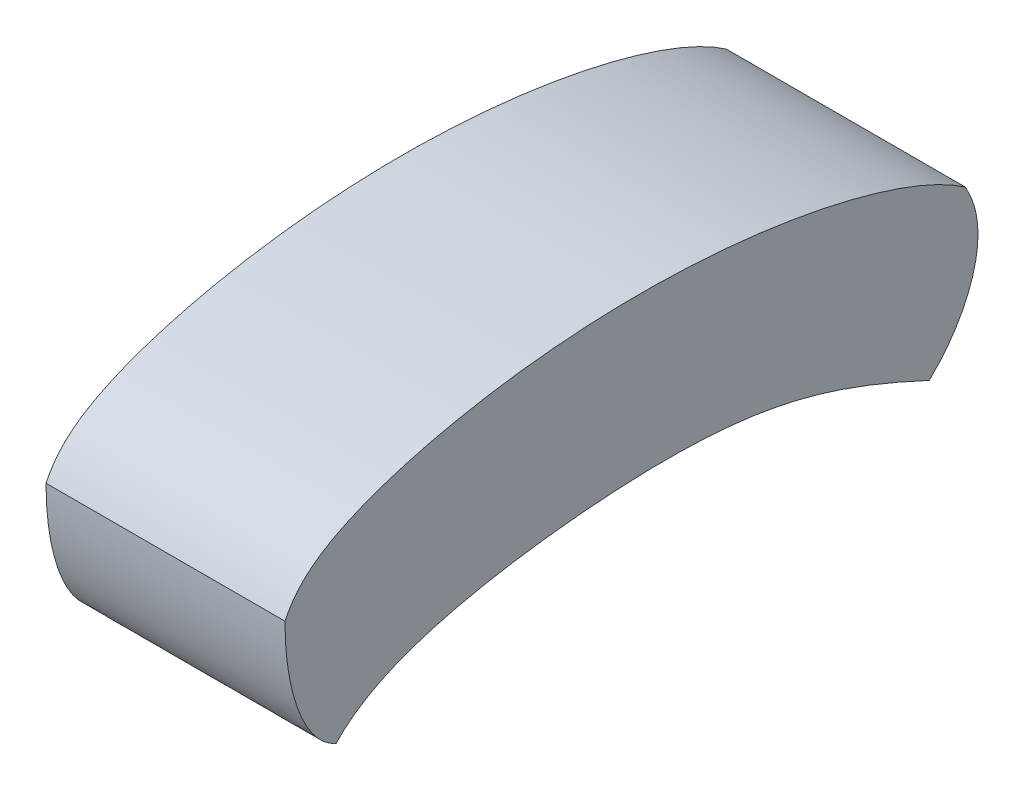
ISO-10303-21;
HEADER;
FILE_DESCRIPTION(('STEP AP214'),'2;1');
FILE_NAME('part.step','',(''),(''),'','','');
FILE_SCHEMA(('AUTOMOTIVE_DESIGN { 1 0 10303 214 1 1 1 1 }'));
ENDSEC;
DATA;
#1=APPLICATION_CONTEXT('core data for automotive mechanical design processes');
#2=APPLICATION_PROTOCOL_DEFINITION('international standard','automotive_design',2000,#1);
#3=PRODUCT_CONTEXT('',#1,'mechanical');
#4=PRODUCT('Part','Part','',(#3));
#5=PRODUCT_RELATED_PRODUCT_CATEGORY('part','',(#4));
#6=PRODUCT_DEFINITION_FORMATION('','',#4);
#7=PRODUCT_DEFINITION_CONTEXT('part definition',#1,'design');
#8=PRODUCT_DEFINITION('design','',#6,#7);
#9=PRODUCT_DEFINITION_SHAPE('','',#8);
#10=(LENGTH_UNIT() NAMED_UNIT(*) SI_UNIT(.MILLI.,.METRE.));
#11=(NAMED_UNIT(*) PLANE_ANGLE_UNIT() SI_UNIT($,.RADIAN.));
#12=(NAMED_UNIT(*) SI_UNIT($,.STERADIAN.) SOLID_ANGLE_UNIT());
#13=UNCERTAINTY_MEASURE_WITH_UNIT(LENGTH_MEASURE(1.E-05),#10,'distance_accuracy_value','');
#14=(GEOMETRIC_REPRESENTATION_CONTEXT(3) GLOBAL_UNCERTAINTY_ASSIGNED_CONTEXT((#13)) GLOBAL_UNIT_ASSIGNED_CONTEXT((#10,
#11,#12)) REPRESENTATION_CONTEXT('',''));
#15=CARTESIAN_POINT('',(0.,0.,0.));
#16=DIRECTION('',(0.,0.,1.));
#17=DIRECTION('',(1.,0.,0.));
#18=AXIS2_PLACEMENT_3D('',#15,#16,#17);
#19=CARTESIAN_POINT('',(-120.,-7.7668418799346,206.219942205809));
#20=CARTESIAN_POINT('',(-120.,-40.3753479847674,206.219942205809));
#21=CARTESIAN_POINT('',(-120.,-67.1771863531175,196.208397878389));
#22=CARTESIAN_POINT('',(-120.,-73.7668418799346,180.471436413235));
#23=B_SPLINE_CURVE_WITH_KNOTS('',3,(#19,#20,#21,#22),.UNSPECIFIED.,.F.,.F.,(4,4),(0.,1.),.UNSPECIFIED.);
#24=DIRECTION('',(1.,0.,0.));
#25=VECTOR('',#24,1.);
#26=SURFACE_OF_LINEAR_EXTRUSION('',#23,#25);
#27=CARTESIAN_POINT('',(0.,-7.7668418799346,206.219942205809));
#28=CARTESIAN_POINT('',(0.,-40.3753479847674,206.219942205809));
#29=CARTESIAN_POINT('',(0.,-67.1771863531175,196.208397878389));
#30=CARTESIAN_POINT('',(0.,-73.7668418799346,180.471436413235));
#31=B_SPLINE_CURVE_WITH_KNOTS('',3,(#27,#28,#29,#30),.UNSPECIFIED.,.F.,.F.,(4,4),(0.,1.),.UNSPECIFIED.);
#32=CARTESIAN_POINT('',(0.,-7.7668418799346,206.219942205809));
#33=VERTEX_POINT('',#32);
#34=CARTESIAN_POINT('',(0.,-73.7668418799346,180.471436413235));
#35=VERTEX_POINT('',#34);
#36=EDGE_CURVE('E129',#33,#35,#31,.T.);
#37=ORIENTED_EDGE('',*,*,#36,.F.);
#38=DIRECTION('',(1.,0.,0.));
#39=VECTOR('',#38,1.);
#40=CARTESIAN_POINT('',(-120.,-7.7668418799346,206.219942205809));
#41=LINE('',#40,#39);
#42=CARTESIAN_POINT('',(-120.,-7.7668418799346,206.219942205809));
#43=VERTEX_POINT('',#42);
#44=EDGE_CURVE('E11',#43,#33,#41,.T.);
#45=ORIENTED_EDGE('',*,*,#44,.F.);
#46=CARTESIAN_POINT('',(-120.,-73.7668418799346,180.471436413235));
#47=VERTEX_POINT('',#46);
#48=EDGE_CURVE('E100',#43,#47,#23,.T.);
#49=ORIENTED_EDGE('',*,*,#48,.T.);
#50=DIRECTION('',(1.,0.,0.));
#51=VECTOR('',#50,1.);
#52=CARTESIAN_POINT('',(-120.,-73.7668418799346,180.471436413235));
#53=LINE('',#52,#51);
#54=EDGE_CURVE('E45',#47,#35,#53,.T.);
#55=ORIENTED_EDGE('',*,*,#54,.T.);
#56=EDGE_LOOP('',(#37,#45,#49,#55));
#57=FACE_BOUND('',#56,.T.);
#58=ADVANCED_FACE('F41',(#57),#26,.T.);
#59=CARTESIAN_POINT('',(-120.,10.2732919844896,-135.38175136237));
#60=CARTESIAN_POINT('',(-120.,30.7881800122377,-105.564219998052));
#61=CARTESIAN_POINT('',(-120.,47.1621964827488,-49.8854655813096));
#62=CARTESIAN_POINT('',(-120.,57.7869736278701,39.9699945070684));
#63=CARTESIAN_POINT('',(-120.,48.743530735788,96.7546484192631));
#64=CARTESIAN_POINT('',(-120.,28.4154140411429,172.026174022097));
#65=CARTESIAN_POINT('',(-120.,17.7508769704576,193.804570038754));
#66=CARTESIAN_POINT('',(-120.,-7.7668418799346,206.219942205809));
#67=B_SPLINE_CURVE_WITH_KNOTS('',7,(#59,#60,#61,#62,#63,#64,#65,#66),.UNSPECIFIED.,.F.,.F.,(8,
8),(0.,1.),.UNSPECIFIED.);
#68=DIRECTION('',(1.,0.,0.));
#69=VECTOR('',#68,1.);
#70=SURFACE_OF_LINEAR_EXTRUSION('',#67,#69);
#71=CARTESIAN_POINT('',(0.,10.2732919844896,-135.38175136237));
#72=CARTESIAN_POINT('',(0.,30.7881800122377,-105.564219998052));
#73=CARTESIAN_POINT('',(0.,47.1621964827488,-49.8854655813096));
#74=CARTESIAN_POINT('',(0.,57.7869736278701,39.9699945070684));
#75=CARTESIAN_POINT('',(0.,48.743530735788,96.7546484192631));
#76=CARTESIAN_POINT('',(0.,28.4154140411429,172.026174022097));
#77=CARTESIAN_POINT('',(0.,17.7508769704576,193.804570038754));
#78=CARTESIAN_POINT('',(0.,-7.7668418799346,206.219942205809));
#79=B_SPLINE_CURVE_WITH_KNOTS('',7,(#71,#72,#73,#74,#75,#76,#77,#78),.UNSPECIFIED.,.F.,.F.,(8,
8),(0.,1.),.UNSPECIFIED.);
#80=CARTESIAN_POINT('',(0.,10.2732919844896,-135.38175136237));
#81=VERTEX_POINT('',#80);
#82=EDGE_CURVE('E102',#81,#33,#79,.T.);
#83=ORIENTED_EDGE('',*,*,#82,.F.);
#84=DIRECTION('',(1.,0.,0.));
#85=VECTOR('',#84,1.);
#86=CARTESIAN_POINT('',(-120.,10.2732919844896,-135.38175136237));
#87=LINE('',#86,#85);
#88=CARTESIAN_POINT('',(-120.,10.2732919844896,-135.38175136237));
#89=VERTEX_POINT('',#88);
#90=EDGE_CURVE('E51',#89,#81,#87,.T.);
#91=ORIENTED_EDGE('',*,*,#90,.F.);
#92=EDGE_CURVE('E97',#89,#43,#67,.T.);
#93=ORIENTED_EDGE('',*,*,#92,.T.);
#94=ORIENTED_EDGE('',*,*,#44,.T.);
#95=EDGE_LOOP('',(#83,#91,#93,#94));
#96=FACE_BOUND('',#95,.T.);
#97=ADVANCED_FACE('F120',(#96),#70,.T.);
#98=CARTESIAN_POINT('',(-120.,-64.8462005363146,-117.340743827617));
#99=CARTESIAN_POINT('',(-120.,-45.9949308062452,-137.462177042785));
#100=CARTESIAN_POINT('',(-120.,-22.2461543438269,-144.715585034908));
#101=CARTESIAN_POINT('',(-120.,-6.18582652069124,-144.715585034908));
#102=CARTESIAN_POINT('',(-120.,10.2732919844896,-135.38175136237));
#103=B_SPLINE_CURVE_WITH_KNOTS('',4,(#98,#99,#100,#101,#102),.UNSPECIFIED.,.F.,.F.,(5,5),(0.,
1.),.UNSPECIFIED.);
#104=DIRECTION('',(1.,0.,0.));
#105=VECTOR('',#104,1.);
#106=SURFACE_OF_LINEAR_EXTRUSION('',#103,#105);
#107=CARTESIAN_POINT('',(0.,-64.8462005363146,-117.340743827617));
#108=CARTESIAN_POINT('',(0.,-45.9949308062452,-137.462177042785));
#109=CARTESIAN_POINT('',(0.,-22.2461543438269,-144.715585034908));
#110=CARTESIAN_POINT('',(0.,-6.18582652069124,-144.715585034908));
#111=CARTESIAN_POINT('',(0.,10.2732919844896,-135.38175136237));
#112=B_SPLINE_CURVE_WITH_KNOTS('',4,(#107,#108,#109,#110,#111),.UNSPECIFIED.,.F.,.F.,(5,5),(0.,
1.),.UNSPECIFIED.);
#113=CARTESIAN_POINT('',(0.,-64.8462005363146,-117.340743827617));
#114=VERTEX_POINT('',#113);
#115=EDGE_CURVE('E92',#114,#81,#112,.T.);
#116=ORIENTED_EDGE('',*,*,#115,.F.);
#117=DIRECTION('',(1.,0.,0.));
#118=VECTOR('',#117,1.);
#119=CARTESIAN_POINT('',(-120.,-64.8462005363146,-117.340743827617));
#120=LINE('',#119,#118);
#121=CARTESIAN_POINT('',(-120.,-64.8462005363146,-117.340743827617));
#122=VERTEX_POINT('',#121);
#123=EDGE_CURVE('E87',#122,#114,#120,.T.);
#124=ORIENTED_EDGE('',*,*,#123,.F.);
#125=EDGE_CURVE('E90',#122,#89,#103,.T.);
#126=ORIENTED_EDGE('',*,*,#125,.T.);
#127=ORIENTED_EDGE('',*,*,#90,.T.);
#128=EDGE_LOOP('',(#116,#124,#126,#127));
#129=FACE_BOUND('',#128,.T.);
#130=ADVANCED_FACE('F89',(#129),#106,.T.);
#131=CARTESIAN_POINT('',(-120.,-73.7668418799346,180.471436413235));
#132=CARTESIAN_POINT('',(-120.,-45.6325114885177,154.395715562654));
#133=CARTESIAN_POINT('',(-120.,-31.9084478829484,96.7546484192631));
#134=CARTESIAN_POINT('',(-120.,-31.9084478829484,-3.43101590139225));
#135=CARTESIAN_POINT('',(-120.,-21.6154001787715,-24.7033144900245));
#136=CARTESIAN_POINT('',(-120.,-64.8462005363146,-117.340743827617));
#137=B_SPLINE_CURVE_WITH_KNOTS('',5,(#131,#132,#133,#134,#135,#136),.UNSPECIFIED.,.F.,.F.,(6,6),
(0.,1.),.UNSPECIFIED.);
#138=DIRECTION('',(1.,0.,0.));
#139=VECTOR('',#138,1.);
#140=SURFACE_OF_LINEAR_EXTRUSION('',#137,#139);
#141=CARTESIAN_POINT('',(0.,-73.7668418799346,180.471436413235));
#142=CARTESIAN_POINT('',(0.,-45.6325114885177,154.395715562654));
#143=CARTESIAN_POINT('',(0.,-31.9084478829484,96.7546484192631));
#144=CARTESIAN_POINT('',(0.,-31.9084478829484,-3.43101590139225));
#145=CARTESIAN_POINT('',(0.,-21.6154001787715,-24.7033144900245));
#146=CARTESIAN_POINT('',(0.,-64.8462005363146,-117.340743827617));
#147=B_SPLINE_CURVE_WITH_KNOTS('',5,(#141,#142,#143,#144,#145,#146),.UNSPECIFIED.,.F.,.F.,(6,6),
(0.,1.),.UNSPECIFIED.);
#148=EDGE_CURVE('E137',#35,#114,#147,.T.);
#149=ORIENTED_EDGE('',*,*,#148,.F.);
#150=ORIENTED_EDGE('',*,*,#54,.F.);
#151=EDGE_CURVE('E96',#47,#122,#137,.T.);
#152=ORIENTED_EDGE('',*,*,#151,.T.);
#153=ORIENTED_EDGE('',*,*,#123,.T.);
#154=EDGE_LOOP('',(#149,#150,#152,#153));
#155=FACE_BOUND('',#154,.T.);
#156=ADVANCED_FACE('F99',(#155),#140,.T.);
#157=CARTESIAN_POINT('',(-120.,-50.5239108466905,199.247049858955));
#158=DIRECTION('',(1.,0.,0.));
#159=DIRECTION('',(0.,0.,-1.));
#160=AXIS2_PLACEMENT_3D('',#157,#158,#159);
#161=PLANE('',#160);
#162=ORIENTED_EDGE('',*,*,#48,.F.);
#163=ORIENTED_EDGE('',*,*,#92,.F.);
#164=ORIENTED_EDGE('',*,*,#125,.F.);
#165=ORIENTED_EDGE('',*,*,#151,.F.);
#166=EDGE_LOOP('',(#162,#163,#164,#165));
#167=FACE_BOUND('',#166,.T.);
#168=ADVANCED_FACE('F95',(#167),#161,.F.);
#169=CARTESIAN_POINT('',(0.,-50.5239108466905,199.247049858955));
#170=DIRECTION('',(1.,0.,0.));
#171=DIRECTION('',(0.,0.,-1.));
#172=AXIS2_PLACEMENT_3D('',#169,#170,#171);
#173=PLANE('',#172);
#174=ORIENTED_EDGE('',*,*,#36,.T.);
#175=ORIENTED_EDGE('',*,*,#148,.T.);
#176=ORIENTED_EDGE('',*,*,#115,.T.);
#177=ORIENTED_EDGE('',*,*,#82,.T.);
#178=EDGE_LOOP('',(#174,#175,#176,#177));
#179=FACE_BOUND('',#178,.T.);
#180=ADVANCED_FACE('F123',(#179),#173,.T.);
#181=CLOSED_SHELL('',(#58,#97,#130,#156,#168,#180));
#182=MANIFOLD_SOLID_BREP('B2',#181);
#183=ADVANCED_BREP_SHAPE_REPRESENTATION('',(#18,#182),#14);
#184=SHAPE_DEFINITION_REPRESENTATION(#9,#183);
ENDSEC;
END-ISO-10303-21;
